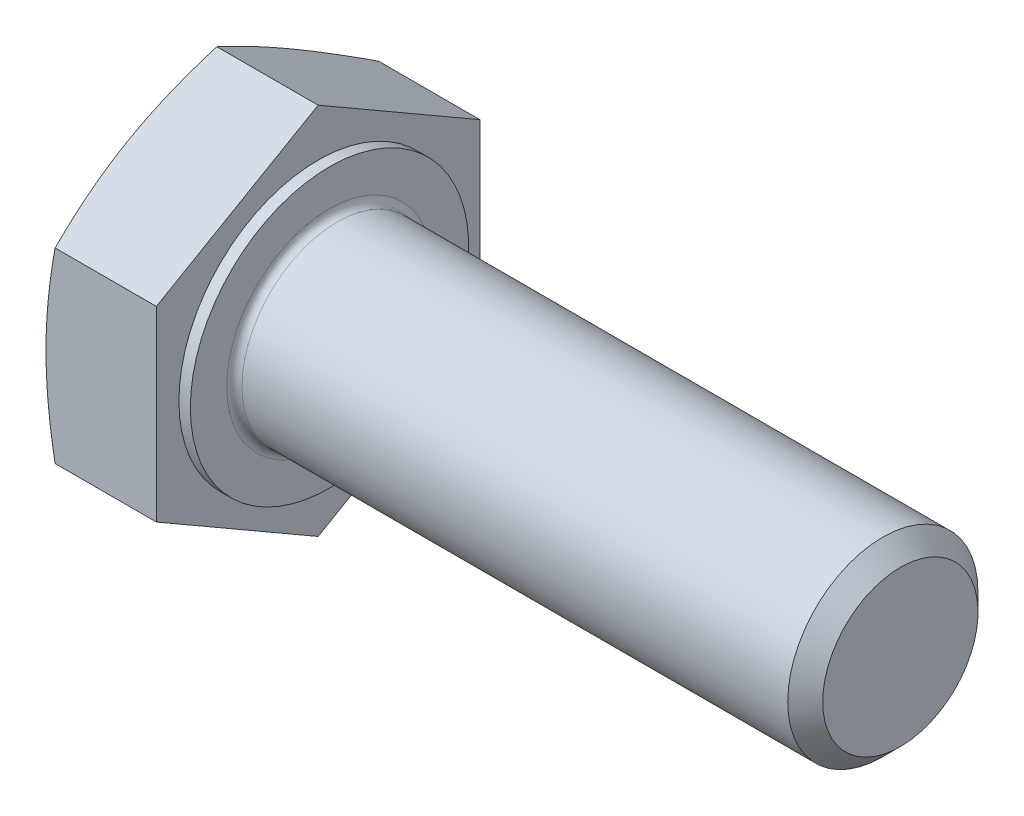
ISO-10303-21;
HEADER;
FILE_DESCRIPTION(('STEP AP214'),'2;1');
FILE_NAME('part.step','',(''),(''),'','','');
FILE_SCHEMA(('AUTOMOTIVE_DESIGN { 1 0 10303 214 1 1 1 1 }'));
ENDSEC;
DATA;
#1=APPLICATION_CONTEXT('core data for automotive mechanical design processes');
#2=APPLICATION_PROTOCOL_DEFINITION('international standard','automotive_design',2000,#1);
#3=PRODUCT_CONTEXT('',#1,'mechanical');
#4=PRODUCT('Part','Part','',(#3));
#5=PRODUCT_RELATED_PRODUCT_CATEGORY('part','',(#4));
#6=PRODUCT_DEFINITION_FORMATION('','',#4);
#7=PRODUCT_DEFINITION_CONTEXT('part definition',#1,'design');
#8=PRODUCT_DEFINITION('design','',#6,#7);
#9=PRODUCT_DEFINITION_SHAPE('','',#8);
#10=(LENGTH_UNIT() NAMED_UNIT(*) SI_UNIT(.MILLI.,.METRE.));
#11=(NAMED_UNIT(*) PLANE_ANGLE_UNIT() SI_UNIT($,.RADIAN.));
#12=(NAMED_UNIT(*) SI_UNIT($,.STERADIAN.) SOLID_ANGLE_UNIT());
#13=UNCERTAINTY_MEASURE_WITH_UNIT(LENGTH_MEASURE(1.E-05),#10,'distance_accuracy_value','');
#14=(GEOMETRIC_REPRESENTATION_CONTEXT(3) GLOBAL_UNCERTAINTY_ASSIGNED_CONTEXT((#13)) GLOBAL_UNIT_ASSIGNED_CONTEXT((#10,
#11,#12)) REPRESENTATION_CONTEXT('',''));
#15=CARTESIAN_POINT('',(0.,0.,0.));
#16=DIRECTION('',(0.,0.,1.));
#17=DIRECTION('',(1.,0.,0.));
#18=AXIS2_PLACEMENT_3D('',#15,#16,#17);
#19=CARTESIAN_POINT('',(-6.4,4.25,0.));
#20=DIRECTION('',(-1.,0.,0.));
#21=DIRECTION('',(0.,0.,1.));
#22=AXIS2_PLACEMENT_3D('',#19,#20,#21);
#23=PLANE('',#22);
#24=CARTESIAN_POINT('',(-6.40000000000127,0.,0.));
#25=DIRECTION('',(1.,0.,0.));
#26=DIRECTION('',(0.,0.,-1.));
#27=AXIS2_PLACEMENT_3D('',#24,#25,#26);
#28=CIRCLE('',#27,8.50000000000047);
#29=CARTESIAN_POINT('',(-6.40000000000136,0.,8.50000000000023));
#30=VERTEX_POINT('',#29);
#31=CARTESIAN_POINT('',(-6.40000000000136,-7.36121593216793,4.25000000000011));
#32=VERTEX_POINT('',#31);
#33=EDGE_CURVE('E90',#30,#32,#28,.T.);
#34=ORIENTED_EDGE('',*,*,#33,.F.);
#35=CARTESIAN_POINT('',(-6.40000000000128,0.,0.));
#36=DIRECTION('',(1.,0.,0.));
#37=DIRECTION('',(0.,0.,-1.));
#38=AXIS2_PLACEMENT_3D('',#35,#36,#37);
#39=CIRCLE('',#38,8.50000000000046);
#40=CARTESIAN_POINT('',(-6.40000000000136,7.36121593216793,4.25000000000012));
#41=VERTEX_POINT('',#40);
#42=EDGE_CURVE('E87',#41,#30,#39,.T.);
#43=ORIENTED_EDGE('',*,*,#42,.F.);
#44=CARTESIAN_POINT('',(-6.40000000000127,0.,0.));
#45=DIRECTION('',(1.,0.,0.));
#46=DIRECTION('',(0.,0.,-1.));
#47=AXIS2_PLACEMENT_3D('',#44,#45,#46);
#48=CIRCLE('',#47,8.50000000000047);
#49=CARTESIAN_POINT('',(-6.40000000000136,7.36121593216793,-4.25000000000012));
#50=VERTEX_POINT('',#49);
#51=EDGE_CURVE('E19',#50,#41,#48,.T.);
#52=ORIENTED_EDGE('',*,*,#51,.F.);
#53=CARTESIAN_POINT('',(-6.40000000000127,0.,0.));
#54=DIRECTION('',(1.,0.,0.));
#55=DIRECTION('',(0.,0.,-1.));
#56=AXIS2_PLACEMENT_3D('',#53,#54,#55);
#57=CIRCLE('',#56,8.50000000000047);
#58=CARTESIAN_POINT('',(-6.40000000000136,0.,-8.50000000000023));
#59=VERTEX_POINT('',#58);
#60=EDGE_CURVE('E506',#59,#50,#57,.T.);
#61=ORIENTED_EDGE('',*,*,#60,.F.);
#62=CARTESIAN_POINT('',(-6.40000000000128,0.,0.));
#63=DIRECTION('',(1.,0.,0.));
#64=DIRECTION('',(0.,0.,-1.));
#65=AXIS2_PLACEMENT_3D('',#62,#63,#64);
#66=CIRCLE('',#65,8.50000000000046);
#67=CARTESIAN_POINT('',(-6.40000000000136,-7.36121593216793,-4.25000000000011));
#68=VERTEX_POINT('',#67);
#69=EDGE_CURVE('E147',#68,#59,#66,.T.);
#70=ORIENTED_EDGE('',*,*,#69,.F.);
#71=CARTESIAN_POINT('',(-6.40000000000127,0.,0.));
#72=DIRECTION('',(1.,0.,0.));
#73=DIRECTION('',(0.,0.,-1.));
#74=AXIS2_PLACEMENT_3D('',#71,#72,#73);
#75=CIRCLE('',#74,8.50000000000047);
#76=EDGE_CURVE('E509',#32,#68,#75,.T.);
#77=ORIENTED_EDGE('',*,*,#76,.F.);
#78=EDGE_LOOP('',(#34,#43,#52,#61,#70,#77));
#79=FACE_BOUND('',#78,.T.);
#80=ADVANCED_FACE('F16',(#79),#23,.T.);
#81=CARTESIAN_POINT('',(-5.918524048893,0.,0.));
#82=DIRECTION('',(1.,0.,0.));
#83=DIRECTION('',(0.,0.,-1.));
#84=AXIS2_PLACEMENT_3D('',#81,#82,#83);
#85=CONICAL_SURFACE('',#84,9.82284430368152,1.22173047639618);
#86=CARTESIAN_POINT('',(-5.92139567484408,9.81495457622379,2.54587123403679E-13));
#87=CARTESIAN_POINT('',(-5.99514021020739,9.61243007709429,-0.350782722269461));
#88=CARTESIAN_POINT('',(-6.06224062107865,9.40922554203592,-0.702743301318972));
#89=CARTESIAN_POINT('',(-6.18019462424627,9.00208128296604,-1.407937844038));
#90=CARTESIAN_POINT('',(-6.23108168234717,8.79814396360323,-1.76116764273378));
#91=CARTESIAN_POINT('',(-6.29326632530469,8.49147018097733,-2.29234221559119));
#92=CARTESIAN_POINT('',(-6.31163978869926,8.38909117213201,-2.46966786053981));
#93=CARTESIAN_POINT('',(-6.34338074151676,8.18413855501416,-2.82465620653214));
#94=CARTESIAN_POINT('',(-6.35674826774736,8.08156494817804,-3.00231890508789));
#95=CARTESIAN_POINT('',(-6.37826159371544,7.87606803857807,-3.35824999331343));
#96=CARTESIAN_POINT('',(-6.38639656999418,7.77314445086015,-3.53651887653813));
#97=CARTESIAN_POINT('',(-6.39727456026643,7.56721976510595,-3.89319089479707));
#98=CARTESIAN_POINT('',(-6.40001723033578,7.46421866254483,-4.07159403766854));
#99=CARTESIAN_POINT('',(-6.40000000000144,7.36121593216773,-4.25));
#100=B_SPLINE_CURVE_WITH_KNOTS('',3,(#86,#87,#88,#89,#90,#91,#92,#93,#94,#95,#96,#97,#98,#99),
.UNSPECIFIED.,.F.,.F.,(4,2,2,2,2,2,4),(0.,1.23530443060448,2.46804231165356,3.08472875732633,
3.70141066853513,4.31936411030344,4.93735696419116),.UNSPECIFIED.);
#101=CARTESIAN_POINT('',(-5.92139567484408,9.81495457622379,0.));
#102=VERTEX_POINT('',#101);
#103=EDGE_CURVE('E107',#102,#50,#100,.T.);
#104=ORIENTED_EDGE('',*,*,#103,.T.);
#105=ORIENTED_EDGE('',*,*,#51,.T.);
#106=CARTESIAN_POINT('',(-6.40000000000144,7.36121593216773,4.25));
#107=CARTESIAN_POINT('',(-6.40001723033578,7.46421866254483,4.07159403766855));
#108=CARTESIAN_POINT('',(-6.39727456026643,7.56721976510595,3.89319089479708));
#109=CARTESIAN_POINT('',(-6.38639656999418,7.77314445086015,3.53651887653814));
#110=CARTESIAN_POINT('',(-6.37826159371544,7.87606803857807,3.35824999331343));
#111=CARTESIAN_POINT('',(-6.35674826774736,8.08156494817804,3.00231890508789));
#112=CARTESIAN_POINT('',(-6.34338074151676,8.18413855501416,2.82465620653214));
#113=CARTESIAN_POINT('',(-6.31163978869926,8.38909117213201,2.46966786053982));
#114=CARTESIAN_POINT('',(-6.29326632530469,8.49147018097733,2.29234221559119));
#115=CARTESIAN_POINT('',(-6.23108168234717,8.79814396360323,1.76116764273378));
#116=CARTESIAN_POINT('',(-6.18019462424627,9.00208128296604,1.407937844038));
#117=CARTESIAN_POINT('',(-6.06224062107865,9.40922554203592,0.702743301318973));
#118=CARTESIAN_POINT('',(-5.99514021020739,9.6124300770943,0.350782722269461));
#119=CARTESIAN_POINT('',(-5.92139567484408,9.81495457622379,-2.55438031837585E-13));
#120=B_SPLINE_CURVE_WITH_KNOTS('',3,(#106,#107,#108,#109,#110,#111,#112,#113,#114,#115,#116,
#117,#118,#119),.UNSPECIFIED.,.F.,.F.,(4,2,2,2,2,2,4),(0.,0.617992853887719,1.23594629565604,
1.85262820686484,2.46931465253761,3.70205253358668,4.93735696419117),.UNSPECIFIED.);
#121=EDGE_CURVE('E101',#41,#102,#120,.T.);
#122=ORIENTED_EDGE('',*,*,#121,.T.);
#123=EDGE_LOOP('',(#104,#105,#122));
#124=FACE_BOUND('',#123,.T.);
#125=ADVANCED_FACE('F105',(#124),#85,.T.);
#126=CARTESIAN_POINT('',(-5.918524048893,0.,0.));
#127=DIRECTION('',(1.,0.,0.));
#128=DIRECTION('',(0.,0.,-1.));
#129=AXIS2_PLACEMENT_3D('',#126,#127,#128);
#130=CONICAL_SURFACE('',#129,9.82284430368152,1.22173047639618);
#131=CARTESIAN_POINT('',(-5.92139567484408,4.90747728811167,8.50000000000026));
#132=CARTESIAN_POINT('',(-5.99514021020739,5.11000178724116,8.14921727773054));
#133=CARTESIAN_POINT('',(-6.06224062107865,5.31320632229953,7.79725669868103));
#134=CARTESIAN_POINT('',(-6.18019462424627,5.72035058136942,7.092062155962));
#135=CARTESIAN_POINT('',(-6.23108168234717,5.92428790073223,6.73883235726622));
#136=CARTESIAN_POINT('',(-6.29326632530469,6.23096168335813,6.20765778440881));
#137=CARTESIAN_POINT('',(-6.31163978869926,6.33334069220345,6.03033213946018));
#138=CARTESIAN_POINT('',(-6.34338074151676,6.5382933093213,5.67534379346786));
#139=CARTESIAN_POINT('',(-6.35674826774736,6.64086691615741,5.49768109491211));
#140=CARTESIAN_POINT('',(-6.37826159371544,6.84636382575739,5.14175000668657));
#141=CARTESIAN_POINT('',(-6.38639656999418,6.9492874134753,4.96348112346186));
#142=CARTESIAN_POINT('',(-6.39727456026643,7.15521209922951,4.60680910520292));
#143=CARTESIAN_POINT('',(-6.40001723033578,7.25821320179063,4.42840596233146));
#144=CARTESIAN_POINT('',(-6.40000000000144,7.36121593216773,4.25));
#145=B_SPLINE_CURVE_WITH_KNOTS('',3,(#131,#132,#133,#134,#135,#136,#137,#138,#139,#140,#141,
#142,#143,#144),.UNSPECIFIED.,.F.,.F.,(4,2,2,2,2,2,4),(0.,1.23530443060448,2.46804231165356,
3.08472875732633,3.70141066853513,4.31936411030345,4.93735696419117),.UNSPECIFIED.);
#146=CARTESIAN_POINT('',(-5.92139567484408,4.90747728811189,8.50000000000013));
#147=VERTEX_POINT('',#146);
#148=EDGE_CURVE('E95',#147,#41,#145,.T.);
#149=ORIENTED_EDGE('',*,*,#148,.T.);
#150=ORIENTED_EDGE('',*,*,#42,.T.);
#151=CARTESIAN_POINT('',(-6.40000000000144,0.,8.5));
#152=CARTESIAN_POINT('',(-6.40001723033578,0.2060054607542,8.5));
#153=CARTESIAN_POINT('',(-6.39727456026643,0.412007665876436,8.5));
#154=CARTESIAN_POINT('',(-6.38639656999418,0.823857037384849,8.5));
#155=CARTESIAN_POINT('',(-6.37826159371544,1.02970421282068,8.5));
#156=CARTESIAN_POINT('',(-6.35674826774736,1.44069803202063,8.5));
#157=CARTESIAN_POINT('',(-6.34338074151676,1.64584524569286,8.5));
#158=CARTESIAN_POINT('',(-6.31163978869926,2.05575047992856,8.5));
#159=CARTESIAN_POINT('',(-6.29326632530469,2.26050849761919,8.5));
#160=CARTESIAN_POINT('',(-6.23108168234717,2.873856062871,8.5));
#161=CARTESIAN_POINT('',(-6.18019462424627,3.28173070159661,8.5));
#162=CARTESIAN_POINT('',(-6.06224062107865,4.09601921973639,8.5));
#163=CARTESIAN_POINT('',(-5.99514021020739,4.50242828985313,8.5));
#164=CARTESIAN_POINT('',(-5.92139567484408,4.90747728811211,8.5));
#165=B_SPLINE_CURVE_WITH_KNOTS('',3,(#151,#152,#153,#154,#155,#156,#157,#158,#159,#160,#161,
#162,#163,#164),.UNSPECIFIED.,.F.,.F.,(4,2,2,2,2,2,4),(0.,0.617992853887719,1.23594629565604,
1.85262820686484,2.46931465253761,3.70205253358668,4.93735696419116),.UNSPECIFIED.);
#166=EDGE_CURVE('E97',#30,#147,#165,.T.);
#167=ORIENTED_EDGE('',*,*,#166,.T.);
#168=EDGE_LOOP('',(#149,#150,#167));
#169=FACE_BOUND('',#168,.T.);
#170=ADVANCED_FACE('F96',(#169),#130,.T.);
#171=CARTESIAN_POINT('',(-5.918524048893,0.,0.));
#172=DIRECTION('',(1.,0.,0.));
#173=DIRECTION('',(0.,0.,-1.));
#174=AXIS2_PLACEMENT_3D('',#171,#172,#173);
#175=CONICAL_SURFACE('',#174,9.82284430368152,1.22173047639618);
#176=CARTESIAN_POINT('',(-5.92139567484408,-4.90747728811211,8.5));
#177=CARTESIAN_POINT('',(-5.99514021020739,-4.50242828985313,8.5));
#178=CARTESIAN_POINT('',(-6.06224062107865,-4.09601921973639,8.5));
#179=CARTESIAN_POINT('',(-6.18019462424627,-3.28173070159661,8.5));
#180=CARTESIAN_POINT('',(-6.23108168234717,-2.873856062871,8.5));
#181=CARTESIAN_POINT('',(-6.29326632530469,-2.26050849761919,8.5));
#182=CARTESIAN_POINT('',(-6.31163978869926,-2.05575047992856,8.5));
#183=CARTESIAN_POINT('',(-6.34338074151676,-1.64584524569286,8.5));
#184=CARTESIAN_POINT('',(-6.35674826774736,-1.44069803202063,8.5));
#185=CARTESIAN_POINT('',(-6.37826159371544,-1.02970421282068,8.5));
#186=CARTESIAN_POINT('',(-6.38639656999418,-0.823857037384847,8.5));
#187=CARTESIAN_POINT('',(-6.39727456026643,-0.412007665876435,8.5));
#188=CARTESIAN_POINT('',(-6.40001723033578,-0.206005460754199,8.5));
#189=CARTESIAN_POINT('',(-6.40000000000144,0.,8.5));
#190=B_SPLINE_CURVE_WITH_KNOTS('',3,(#176,#177,#178,#179,#180,#181,#182,#183,#184,#185,#186,
#187,#188,#189),.UNSPECIFIED.,.F.,.F.,(4,2,2,2,2,2,4),(0.,1.23530443060449,2.46804231165356,
3.08472875732633,3.70141066853513,4.31936411030345,4.93735696419116),.UNSPECIFIED.);
#191=CARTESIAN_POINT('',(-5.92139567484408,-4.90747728811189,8.50000000000013));
#192=VERTEX_POINT('',#191);
#193=EDGE_CURVE('E114',#192,#30,#190,.T.);
#194=ORIENTED_EDGE('',*,*,#193,.T.);
#195=ORIENTED_EDGE('',*,*,#33,.T.);
#196=CARTESIAN_POINT('',(-6.40000000000144,-7.36121593216773,4.25));
#197=CARTESIAN_POINT('',(-6.40001723033578,-7.25821320179063,4.42840596233145));
#198=CARTESIAN_POINT('',(-6.39727456026643,-7.15521209922951,4.60680910520292));
#199=CARTESIAN_POINT('',(-6.38639656999418,-6.9492874134753,4.96348112346186));
#200=CARTESIAN_POINT('',(-6.37826159371544,-6.84636382575739,5.14175000668657));
#201=CARTESIAN_POINT('',(-6.35674826774736,-6.64086691615741,5.49768109491211));
#202=CARTESIAN_POINT('',(-6.34338074151676,-6.5382933093213,5.67534379346786));
#203=CARTESIAN_POINT('',(-6.31163978869926,-6.33334069220345,6.03033213946018));
#204=CARTESIAN_POINT('',(-6.29326632530469,-6.23096168335813,6.20765778440881));
#205=CARTESIAN_POINT('',(-6.23108168234717,-5.92428790073223,6.73883235726622));
#206=CARTESIAN_POINT('',(-6.18019462424627,-5.72035058136942,7.092062155962));
#207=CARTESIAN_POINT('',(-6.06224062107865,-5.31320632229953,7.79725669868103));
#208=CARTESIAN_POINT('',(-5.99514021020739,-5.11000178724116,8.14921727773054));
#209=CARTESIAN_POINT('',(-5.92139567484408,-4.90747728811167,8.50000000000026));
#210=B_SPLINE_CURVE_WITH_KNOTS('',3,(#196,#197,#198,#199,#200,#201,#202,#203,#204,#205,#206,
#207,#208,#209),.UNSPECIFIED.,.F.,.F.,(4,2,2,2,2,2,4),(0.,0.61799285388772,1.23594629565604,
1.85262820686484,2.46931465253761,3.70205253358668,4.93735696419117),.UNSPECIFIED.);
#211=EDGE_CURVE('E228',#32,#192,#210,.T.);
#212=ORIENTED_EDGE('',*,*,#211,.T.);
#213=EDGE_LOOP('',(#194,#195,#212));
#214=FACE_BOUND('',#213,.T.);
#215=ADVANCED_FACE('F217',(#214),#175,.T.);
#216=CARTESIAN_POINT('',(-5.918524048893,0.,0.));
#217=DIRECTION('',(1.,0.,0.));
#218=DIRECTION('',(0.,0.,-1.));
#219=AXIS2_PLACEMENT_3D('',#216,#217,#218);
#220=CONICAL_SURFACE('',#219,9.82284430368152,1.22173047639618);
#221=ORIENTED_EDGE('',*,*,#76,.T.);
#222=CARTESIAN_POINT('',(-6.40000000000144,-7.36121593216773,-4.25));
#223=CARTESIAN_POINT('',(-6.40001723033578,-7.46421866254483,-4.07159403766854));
#224=CARTESIAN_POINT('',(-6.39727456026643,-7.56721976510595,-3.89319089479707));
#225=CARTESIAN_POINT('',(-6.38639656999418,-7.77314445086015,-3.53651887653813));
#226=CARTESIAN_POINT('',(-6.37826159371544,-7.87606803857807,-3.35824999331343));
#227=CARTESIAN_POINT('',(-6.35674826774736,-8.08156494817804,-3.00231890508789));
#228=CARTESIAN_POINT('',(-6.34338074151676,-8.18413855501416,-2.82465620653214));
#229=CARTESIAN_POINT('',(-6.31163978869926,-8.38909117213201,-2.46966786053981));
#230=CARTESIAN_POINT('',(-6.29326632530469,-8.49147018097733,-2.29234221559119));
#231=CARTESIAN_POINT('',(-6.23108168234717,-8.79814396360323,-1.76116764273378));
#232=CARTESIAN_POINT('',(-6.18019462424627,-9.00208128296604,-1.407937844038));
#233=CARTESIAN_POINT('',(-6.06224062107865,-9.40922554203592,-0.702743301318973));
#234=CARTESIAN_POINT('',(-5.99514021020739,-9.6124300770943,-0.350782722269462));
#235=CARTESIAN_POINT('',(-5.92139567484408,-9.81495457622379,2.54979865880636E-13));
#236=B_SPLINE_CURVE_WITH_KNOTS('',3,(#222,#223,#224,#225,#226,#227,#228,#229,#230,#231,#232,
#233,#234,#235),.UNSPECIFIED.,.F.,.F.,(4,2,2,2,2,2,4),(0.,0.617992853887719,1.23594629565604,
1.85262820686484,2.46931465253761,3.70205253358668,4.93735696419116),.UNSPECIFIED.);
#237=CARTESIAN_POINT('',(-5.92139567484408,-9.81495457622379,0.));
#238=VERTEX_POINT('',#237);
#239=EDGE_CURVE('E208',#68,#238,#236,.T.);
#240=ORIENTED_EDGE('',*,*,#239,.T.);
#241=CARTESIAN_POINT('',(-5.92139567484408,-9.81495457622379,-2.5423808740031E-13));
#242=CARTESIAN_POINT('',(-5.99514021020739,-9.6124300770943,0.350782722269464));
#243=CARTESIAN_POINT('',(-6.06224062107865,-9.40922554203592,0.702743301318974));
#244=CARTESIAN_POINT('',(-6.18019462424627,-9.00208128296604,1.407937844038));
#245=CARTESIAN_POINT('',(-6.23108168234717,-8.79814396360323,1.76116764273378));
#246=CARTESIAN_POINT('',(-6.29326632530469,-8.49147018097732,2.29234221559119));
#247=CARTESIAN_POINT('',(-6.31163978869926,-8.38909117213201,2.46966786053982));
#248=CARTESIAN_POINT('',(-6.34338074151676,-8.18413855501416,2.82465620653214));
#249=CARTESIAN_POINT('',(-6.35674826774736,-8.08156494817804,3.00231890508789));
#250=CARTESIAN_POINT('',(-6.37826159371544,-7.87606803857807,3.35824999331343));
#251=CARTESIAN_POINT('',(-6.38639656999418,-7.77314445086015,3.53651887653813));
#252=CARTESIAN_POINT('',(-6.39727456026643,-7.56721976510595,3.89319089479707));
#253=CARTESIAN_POINT('',(-6.40001723033578,-7.46421866254483,4.07159403766854));
#254=CARTESIAN_POINT('',(-6.40000000000144,-7.36121593216773,4.25));
#255=B_SPLINE_CURVE_WITH_KNOTS('',3,(#241,#242,#243,#244,#245,#246,#247,#248,#249,#250,#251,
#252,#253,#254),.UNSPECIFIED.,.F.,.F.,(4,2,2,2,2,2,4),(0.,1.23530443060448,2.46804231165356,
3.08472875732633,3.70141066853513,4.31936411030344,4.93735696419116),.UNSPECIFIED.);
#256=EDGE_CURVE('E222',#238,#32,#255,.T.);
#257=ORIENTED_EDGE('',*,*,#256,.T.);
#258=EDGE_LOOP('',(#221,#240,#257));
#259=FACE_BOUND('',#258,.T.);
#260=ADVANCED_FACE('F214',(#259),#220,.T.);
#261=CARTESIAN_POINT('',(-5.918524048893,0.,0.));
#262=DIRECTION('',(1.,0.,0.));
#263=DIRECTION('',(0.,0.,-1.));
#264=AXIS2_PLACEMENT_3D('',#261,#262,#263);
#265=CONICAL_SURFACE('',#264,9.82284430368152,1.22173047639618);
#266=ORIENTED_EDGE('',*,*,#60,.T.);
#267=CARTESIAN_POINT('',(-6.40000000000145,7.36121593216773,-4.25));
#268=CARTESIAN_POINT('',(-6.40001723033579,7.25821320179063,-4.42840596233145));
#269=CARTESIAN_POINT('',(-6.39727456026643,7.15521209922951,-4.60680910520292));
#270=CARTESIAN_POINT('',(-6.38639656999418,6.9492874134753,-4.96348112346186));
#271=CARTESIAN_POINT('',(-6.37826159371544,6.84636382575739,-5.14175000668657));
#272=CARTESIAN_POINT('',(-6.35674826774736,6.64086691615741,-5.49768109491211));
#273=CARTESIAN_POINT('',(-6.34338074151676,6.5382933093213,-5.67534379346786));
#274=CARTESIAN_POINT('',(-6.31163978869926,6.33334069220345,-6.03033213946018));
#275=CARTESIAN_POINT('',(-6.29326632530469,6.23096168335813,-6.20765778440881));
#276=CARTESIAN_POINT('',(-6.23108168234717,5.92428790073223,-6.73883235726622));
#277=CARTESIAN_POINT('',(-6.18019462424627,5.72035058136942,-7.092062155962));
#278=CARTESIAN_POINT('',(-6.06224062107865,5.31320632229953,-7.79725669868103));
#279=CARTESIAN_POINT('',(-5.99514021020739,5.11000178724116,-8.14921727773054));
#280=CARTESIAN_POINT('',(-5.92139567484408,4.90747728811167,-8.50000000000026));
#281=B_SPLINE_CURVE_WITH_KNOTS('',3,(#267,#268,#269,#270,#271,#272,#273,#274,#275,#276,#277,
#278,#279,#280),.UNSPECIFIED.,.F.,.F.,(4,2,2,2,2,2,4),(0.,0.617992853887719,1.23594629565604,
1.85262820686484,2.46931465253761,3.70205253358668,4.93735696419117),.UNSPECIFIED.);
#282=CARTESIAN_POINT('',(-5.92139567484411,4.90747728811175,-8.50000000000013));
#283=VERTEX_POINT('',#282);
#284=EDGE_CURVE('E102',#50,#283,#281,.T.);
#285=ORIENTED_EDGE('',*,*,#284,.T.);
#286=CARTESIAN_POINT('',(-5.92139567484408,4.90747728811211,-8.5));
#287=CARTESIAN_POINT('',(-5.99514021020739,4.50242828985313,-8.5));
#288=CARTESIAN_POINT('',(-6.06224062107865,4.09601921973639,-8.5));
#289=CARTESIAN_POINT('',(-6.18019462424627,3.28173070159661,-8.5));
#290=CARTESIAN_POINT('',(-6.23108168234717,2.873856062871,-8.5));
#291=CARTESIAN_POINT('',(-6.29326632530469,2.26050849761919,-8.5));
#292=CARTESIAN_POINT('',(-6.31163978869926,2.05575047992856,-8.5));
#293=CARTESIAN_POINT('',(-6.34338074151676,1.64584524569286,-8.5));
#294=CARTESIAN_POINT('',(-6.35674826774736,1.44069803202063,-8.5));
#295=CARTESIAN_POINT('',(-6.37826159371544,1.02970421282068,-8.5));
#296=CARTESIAN_POINT('',(-6.38639656999418,0.823857037384847,-8.5));
#297=CARTESIAN_POINT('',(-6.39727456026643,0.412007665876434,-8.5));
#298=CARTESIAN_POINT('',(-6.40001723033579,0.206005460754197,-8.5));
#299=CARTESIAN_POINT('',(-6.40000000000144,0.,-8.5));
#300=B_SPLINE_CURVE_WITH_KNOTS('',3,(#286,#287,#288,#289,#290,#291,#292,#293,#294,#295,#296,
#297,#298,#299),.UNSPECIFIED.,.F.,.F.,(4,2,2,2,2,2,4),(0.,1.23530443060448,2.46804231165356,
3.08472875732633,3.70141066853513,4.31936411030345,4.93735696419117),.UNSPECIFIED.);
#301=EDGE_CURVE('E186',#283,#59,#300,.T.);
#302=ORIENTED_EDGE('',*,*,#301,.T.);
#303=EDGE_LOOP('',(#266,#285,#302));
#304=FACE_BOUND('',#303,.T.);
#305=ADVANCED_FACE('F163',(#304),#265,.T.);
#306=CARTESIAN_POINT('',(-5.918524048893,0.,0.));
#307=DIRECTION('',(1.,0.,0.));
#308=DIRECTION('',(0.,0.,-1.));
#309=AXIS2_PLACEMENT_3D('',#306,#307,#308);
#310=CONICAL_SURFACE('',#309,9.82284430368152,1.22173047639618);
#311=ORIENTED_EDGE('',*,*,#69,.T.);
#312=CARTESIAN_POINT('',(-6.40000000000144,0.,-8.5));
#313=CARTESIAN_POINT('',(-6.40001723033578,-0.2060054607542,-8.5));
#314=CARTESIAN_POINT('',(-6.39727456026643,-0.412007665876437,-8.5));
#315=CARTESIAN_POINT('',(-6.38639656999418,-0.823857037384849,-8.5));
#316=CARTESIAN_POINT('',(-6.37826159371544,-1.02970421282068,-8.5));
#317=CARTESIAN_POINT('',(-6.35674826774736,-1.44069803202063,-8.5));
#318=CARTESIAN_POINT('',(-6.34338074151676,-1.64584524569287,-8.5));
#319=CARTESIAN_POINT('',(-6.31163978869926,-2.05575047992856,-8.5));
#320=CARTESIAN_POINT('',(-6.29326632530469,-2.26050849761919,-8.5));
#321=CARTESIAN_POINT('',(-6.23108168234717,-2.873856062871,-8.5));
#322=CARTESIAN_POINT('',(-6.18019462424627,-3.28173070159662,-8.5));
#323=CARTESIAN_POINT('',(-6.06224062107865,-4.09601921973639,-8.5));
#324=CARTESIAN_POINT('',(-5.99514021020739,-4.50242828985313,-8.5));
#325=CARTESIAN_POINT('',(-5.92139567484408,-4.90747728811212,-8.5));
#326=B_SPLINE_CURVE_WITH_KNOTS('',3,(#312,#313,#314,#315,#316,#317,#318,#319,#320,#321,#322,
#323,#324,#325),.UNSPECIFIED.,.F.,.F.,(4,2,2,2,2,2,4),(0.,0.617992853887718,1.23594629565604,
1.85262820686484,2.46931465253761,3.70205253358668,4.93735696419117),.UNSPECIFIED.);
#327=CARTESIAN_POINT('',(-5.92139567484408,-4.90747728811189,-8.50000000000013));
#328=VERTEX_POINT('',#327);
#329=EDGE_CURVE('E178',#59,#328,#326,.T.);
#330=ORIENTED_EDGE('',*,*,#329,.T.);
#331=CARTESIAN_POINT('',(-5.92139567484408,-4.90747728811167,-8.50000000000025));
#332=CARTESIAN_POINT('',(-5.99514021020739,-5.11000178724116,-8.14921727773054));
#333=CARTESIAN_POINT('',(-6.06224062107865,-5.31320632229954,-7.79725669868102));
#334=CARTESIAN_POINT('',(-6.18019462424627,-5.72035058136942,-7.09206215596199));
#335=CARTESIAN_POINT('',(-6.23108168234717,-5.92428790073223,-6.73883235726622));
#336=CARTESIAN_POINT('',(-6.29326632530469,-6.23096168335814,-6.20765778440881));
#337=CARTESIAN_POINT('',(-6.31163978869926,-6.33334069220345,-6.03033213946018));
#338=CARTESIAN_POINT('',(-6.34338074151676,-6.5382933093213,-5.67534379346786));
#339=CARTESIAN_POINT('',(-6.35674826774736,-6.64086691615741,-5.49768109491211));
#340=CARTESIAN_POINT('',(-6.37826159371544,-6.84636382575739,-5.14175000668657));
#341=CARTESIAN_POINT('',(-6.38639656999418,-6.9492874134753,-4.96348112346186));
#342=CARTESIAN_POINT('',(-6.39727456026643,-7.15521209922951,-4.60680910520292));
#343=CARTESIAN_POINT('',(-6.40001723033579,-7.25821320179063,-4.42840596233145));
#344=CARTESIAN_POINT('',(-6.40000000000145,-7.36121593216773,-4.25));
#345=B_SPLINE_CURVE_WITH_KNOTS('',3,(#331,#332,#333,#334,#335,#336,#337,#338,#339,#340,#341,
#342,#343,#344),.UNSPECIFIED.,.F.,.F.,(4,2,2,2,2,2,4),(0.,1.23530443060448,2.46804231165356,
3.08472875732633,3.70141066853513,4.31936411030344,4.93735696419116),.UNSPECIFIED.);
#346=EDGE_CURVE('E169',#328,#68,#345,.T.);
#347=ORIENTED_EDGE('',*,*,#346,.T.);
#348=EDGE_LOOP('',(#311,#330,#347));
#349=FACE_BOUND('',#348,.T.);
#350=ADVANCED_FACE('F158',(#349),#310,.T.);
#351=CARTESIAN_POINT('',(0.,9.81495457622364,0.));
#352=DIRECTION('',(0.,-0.866025403784439,0.5));
#353=DIRECTION('',(0.,-0.5,-0.866025403784439));
#354=AXIS2_PLACEMENT_3D('',#351,#352,#353);
#355=PLANE('',#354);
#356=DIRECTION('',(1.,0.,0.));
#357=VECTOR('',#356,1.);
#358=CARTESIAN_POINT('',(0.,4.90747728811182,-8.5));
#359=LINE('',#358,#357);
#360=CARTESIAN_POINT('',(-0.6,4.90747728811182,-8.5));
#361=VERTEX_POINT('',#360);
#362=EDGE_CURVE('E349',#361,#283,#359,.F.);
#363=ORIENTED_EDGE('',*,*,#362,.T.);
#364=ORIENTED_EDGE('',*,*,#284,.F.);
#365=ORIENTED_EDGE('',*,*,#103,.F.);
#366=DIRECTION('',(1.,0.,0.));
#367=VECTOR('',#366,1.);
#368=CARTESIAN_POINT('',(0.,9.81495457622364,0.));
#369=LINE('',#368,#367);
#370=CARTESIAN_POINT('',(-0.6,9.81495457622364,0.));
#371=VERTEX_POINT('',#370);
#372=EDGE_CURVE('E112',#102,#371,#369,.T.);
#373=ORIENTED_EDGE('',*,*,#372,.T.);
#374=DIRECTION('',(0.,0.5,0.866025403784439));
#375=VECTOR('',#374,1.);
#376=CARTESIAN_POINT('',(-0.6,4.90747728811182,-8.5));
#377=LINE('',#376,#375);
#378=EDGE_CURVE('E314',#361,#371,#377,.T.);
#379=ORIENTED_EDGE('',*,*,#378,.F.);
#380=EDGE_LOOP('',(#363,#364,#365,#373,#379));
#381=FACE_BOUND('',#380,.T.);
#382=ADVANCED_FACE('F154',(#381),#355,.F.);
#383=CARTESIAN_POINT('',(0.,4.90747728811182,8.5));
#384=DIRECTION('',(0.,-0.866025403784439,-0.5));
#385=DIRECTION('',(0.,0.5,-0.866025403784439));
#386=AXIS2_PLACEMENT_3D('',#383,#384,#385);
#387=PLANE('',#386);
#388=ORIENTED_EDGE('',*,*,#372,.F.);
#389=ORIENTED_EDGE('',*,*,#121,.F.);
#390=ORIENTED_EDGE('',*,*,#148,.F.);
#391=DIRECTION('',(-1.,0.,0.));
#392=VECTOR('',#391,1.);
#393=CARTESIAN_POINT('',(0.,4.90747728811182,8.5));
#394=LINE('',#393,#392);
#395=CARTESIAN_POINT('',(-0.6,4.90747728811182,8.5));
#396=VERTEX_POINT('',#395);
#397=EDGE_CURVE('E229',#147,#396,#394,.F.);
#398=ORIENTED_EDGE('',*,*,#397,.T.);
#399=DIRECTION('',(0.,-0.5,0.866025403784439));
#400=VECTOR('',#399,1.);
#401=CARTESIAN_POINT('',(-0.6,9.81495457622364,0.));
#402=LINE('',#401,#400);
#403=EDGE_CURVE('E310',#371,#396,#402,.T.);
#404=ORIENTED_EDGE('',*,*,#403,.F.);
#405=EDGE_LOOP('',(#388,#389,#390,#398,#404));
#406=FACE_BOUND('',#405,.T.);
#407=ADVANCED_FACE('F110',(#406),#387,.F.);
#408=CARTESIAN_POINT('',(0.,-4.90747728811182,8.5));
#409=DIRECTION('',(0.,0.,-1.));
#410=DIRECTION('',(-1.,0.,0.));
#411=AXIS2_PLACEMENT_3D('',#408,#409,#410);
#412=PLANE('',#411);
#413=ORIENTED_EDGE('',*,*,#397,.F.);
#414=ORIENTED_EDGE('',*,*,#166,.F.);
#415=ORIENTED_EDGE('',*,*,#193,.F.);
#416=DIRECTION('',(1.,0.,0.));
#417=VECTOR('',#416,1.);
#418=CARTESIAN_POINT('',(0.,-4.90747728811182,8.5));
#419=LINE('',#418,#417);
#420=CARTESIAN_POINT('',(-0.6,-4.90747728811182,8.5));
#421=VERTEX_POINT('',#420);
#422=EDGE_CURVE('E344',#192,#421,#419,.T.);
#423=ORIENTED_EDGE('',*,*,#422,.T.);
#424=DIRECTION('',(0.,1.,0.));
#425=VECTOR('',#424,1.);
#426=CARTESIAN_POINT('',(-0.6,10.4575,8.5));
#427=LINE('',#426,#425);
#428=EDGE_CURVE('E313',#396,#421,#427,.F.);
#429=ORIENTED_EDGE('',*,*,#428,.F.);
#430=EDGE_LOOP('',(#413,#414,#415,#423,#429));
#431=FACE_BOUND('',#430,.T.);
#432=ADVANCED_FACE('F238',(#431),#412,.F.);
#433=CARTESIAN_POINT('',(0.,-9.81495457622364,0.));
#434=DIRECTION('',(0.,0.866025403784439,-0.5));
#435=DIRECTION('',(0.,0.5,0.866025403784439));
#436=AXIS2_PLACEMENT_3D('',#433,#434,#435);
#437=PLANE('',#436);
#438=ORIENTED_EDGE('',*,*,#422,.F.);
#439=ORIENTED_EDGE('',*,*,#211,.F.);
#440=ORIENTED_EDGE('',*,*,#256,.F.);
#441=DIRECTION('',(1.,0.,0.));
#442=VECTOR('',#441,1.);
#443=CARTESIAN_POINT('',(0.,-9.81495457622364,0.));
#444=LINE('',#443,#442);
#445=CARTESIAN_POINT('',(-0.6,-9.81495457622364,0.));
#446=VERTEX_POINT('',#445);
#447=EDGE_CURVE('E213',#238,#446,#444,.T.);
#448=ORIENTED_EDGE('',*,*,#447,.T.);
#449=DIRECTION('',(0.,-0.5,-0.866025403784439));
#450=VECTOR('',#449,1.);
#451=CARTESIAN_POINT('',(-0.6,-4.90747728811182,8.5));
#452=LINE('',#451,#450);
#453=EDGE_CURVE('E319',#421,#446,#452,.T.);
#454=ORIENTED_EDGE('',*,*,#453,.F.);
#455=EDGE_LOOP('',(#438,#439,#440,#448,#454));
#456=FACE_BOUND('',#455,.T.);
#457=ADVANCED_FACE('F205',(#456),#437,.F.);
#458=CARTESIAN_POINT('',(0.,-4.90747728811182,-8.5));
#459=DIRECTION('',(0.,0.866025403784439,0.5));
#460=DIRECTION('',(0.,-0.5,0.866025403784439));
#461=AXIS2_PLACEMENT_3D('',#458,#459,#460);
#462=PLANE('',#461);
#463=ORIENTED_EDGE('',*,*,#447,.F.);
#464=ORIENTED_EDGE('',*,*,#239,.F.);
#465=ORIENTED_EDGE('',*,*,#346,.F.);
#466=DIRECTION('',(1.,0.,0.));
#467=VECTOR('',#466,1.);
#468=CARTESIAN_POINT('',(0.,-4.90747728811182,-8.5));
#469=LINE('',#468,#467);
#470=CARTESIAN_POINT('',(-0.6,-4.90747728811182,-8.5));
#471=VERTEX_POINT('',#470);
#472=EDGE_CURVE('E34',#328,#471,#469,.T.);
#473=ORIENTED_EDGE('',*,*,#472,.T.);
#474=DIRECTION('',(0.,0.5,-0.866025403784439));
#475=VECTOR('',#474,1.);
#476=CARTESIAN_POINT('',(-0.6,-9.81495457622364,0.));
#477=LINE('',#476,#475);
#478=EDGE_CURVE('E324',#446,#471,#477,.T.);
#479=ORIENTED_EDGE('',*,*,#478,.F.);
#480=EDGE_LOOP('',(#463,#464,#465,#473,#479));
#481=FACE_BOUND('',#480,.T.);
#482=ADVANCED_FACE('F198',(#481),#462,.F.);
#483=CARTESIAN_POINT('',(0.,4.90747728811182,-8.5));
#484=DIRECTION('',(0.,0.,1.));
#485=DIRECTION('',(1.,0.,0.));
#486=AXIS2_PLACEMENT_3D('',#483,#484,#485);
#487=PLANE('',#486);
#488=ORIENTED_EDGE('',*,*,#472,.F.);
#489=ORIENTED_EDGE('',*,*,#329,.F.);
#490=ORIENTED_EDGE('',*,*,#301,.F.);
#491=ORIENTED_EDGE('',*,*,#362,.F.);
#492=DIRECTION('',(0.,1.,0.));
#493=VECTOR('',#492,1.);
#494=CARTESIAN_POINT('',(-0.6,10.4575,-8.5));
#495=LINE('',#494,#493);
#496=EDGE_CURVE('E306',#471,#361,#495,.T.);
#497=ORIENTED_EDGE('',*,*,#496,.F.);
#498=EDGE_LOOP('',(#488,#489,#490,#491,#497));
#499=FACE_BOUND('',#498,.T.);
#500=ADVANCED_FACE('F193',(#499),#487,.F.);
#501=CARTESIAN_POINT('',(-0.6,10.4575,0.));
#502=DIRECTION('',(1.,0.,0.));
#503=DIRECTION('',(0.,0.,-1.));
#504=AXIS2_PLACEMENT_3D('',#501,#502,#503);
#505=PLANE('',#504);
#506=CARTESIAN_POINT('',(-0.6,0.,0.));
#507=DIRECTION('',(-1.,0.,0.));
#508=DIRECTION('',(0.,0.,1.));
#509=AXIS2_PLACEMENT_3D('',#506,#507,#508);
#510=CIRCLE('',#509,7.315);
#511=CARTESIAN_POINT('',(-0.6,0.,7.315));
#512=VERTEX_POINT('',#511);
#513=EDGE_CURVE('E187',#512,#512,#510,.F.);
#514=ORIENTED_EDGE('',*,*,#513,.F.);
#515=EDGE_LOOP('',(#514));
#516=FACE_BOUND('',#515,.T.);
#517=ORIENTED_EDGE('',*,*,#478,.T.);
#518=ORIENTED_EDGE('',*,*,#496,.T.);
#519=ORIENTED_EDGE('',*,*,#378,.T.);
#520=ORIENTED_EDGE('',*,*,#403,.T.);
#521=ORIENTED_EDGE('',*,*,#428,.T.);
#522=ORIENTED_EDGE('',*,*,#453,.T.);
#523=EDGE_LOOP('',(#517,#518,#519,#520,#521,#522));
#524=FACE_BOUND('',#523,.T.);
#525=ADVANCED_FACE('F197',(#516,#524),#505,.T.);
#526=CARTESIAN_POINT('',(-0.3,0.,0.));
#527=DIRECTION('',(-1.,0.,0.));
#528=DIRECTION('',(0.,0.,1.));
#529=AXIS2_PLACEMENT_3D('',#526,#527,#528);
#530=CYLINDRICAL_SURFACE('',#529,7.315);
#531=ORIENTED_EDGE('',*,*,#513,.T.);
#532=EDGE_LOOP('',(#531));
#533=FACE_BOUND('',#532,.T.);
#534=CARTESIAN_POINT('',(0.,0.,0.));
#535=DIRECTION('',(-1.,0.,0.));
#536=DIRECTION('',(0.,0.,1.));
#537=AXIS2_PLACEMENT_3D('',#534,#535,#536);
#538=CIRCLE('',#537,7.315);
#539=CARTESIAN_POINT('',(0.,0.,7.315));
#540=VERTEX_POINT('',#539);
#541=EDGE_CURVE('E301',#540,#540,#538,.F.);
#542=ORIENTED_EDGE('',*,*,#541,.F.);
#543=EDGE_LOOP('',(#542));
#544=FACE_BOUND('',#543,.T.);
#545=ADVANCED_FACE('F288',(#533,#544),#530,.T.);
#546=CARTESIAN_POINT('',(30.,2.04,0.));
#547=DIRECTION('',(1.,0.,0.));
#548=DIRECTION('',(0.,0.,-1.));
#549=AXIS2_PLACEMENT_3D('',#546,#547,#548);
#550=PLANE('',#549);
#551=CARTESIAN_POINT('',(29.9999999999727,0.,0.));
#552=DIRECTION('',(-1.,0.,0.));
#553=DIRECTION('',(0.,0.,1.));
#554=AXIS2_PLACEMENT_3D('',#551,#552,#553);
#555=CIRCLE('',#554,4.08000000004449);
#556=CARTESIAN_POINT('',(29.9999999999727,0.,4.08000000004449));
#557=VERTEX_POINT('',#556);
#558=EDGE_CURVE('E303',#557,#557,#555,.T.);
#559=ORIENTED_EDGE('',*,*,#558,.F.);
#560=EDGE_LOOP('',(#559));
#561=FACE_BOUND('',#560,.T.);
#562=ADVANCED_FACE('F286',(#561),#550,.T.);
#563=CARTESIAN_POINT('',(0.,6.3575,0.));
#564=DIRECTION('',(1.,0.,0.));
#565=DIRECTION('',(0.,0.,-1.));
#566=AXIS2_PLACEMENT_3D('',#563,#564,#565);
#567=PLANE('',#566);
#568=CARTESIAN_POINT('',(0.,0.,0.));
#569=DIRECTION('',(1.,0.,0.));
#570=DIRECTION('',(0.,1.,0.));
#571=AXIS2_PLACEMENT_3D('',#568,#569,#570);
#572=CIRCLE('',#571,5.4);
#573=CARTESIAN_POINT('',(0.,5.4,0.));
#574=VERTEX_POINT('',#573);
#575=EDGE_CURVE('E273',#574,#574,#572,.T.);
#576=ORIENTED_EDGE('',*,*,#575,.F.);
#577=EDGE_LOOP('',(#576));
#578=FACE_BOUND('',#577,.T.);
#579=ORIENTED_EDGE('',*,*,#541,.T.);
#580=EDGE_LOOP('',(#579));
#581=FACE_BOUND('',#580,.T.);
#582=ADVANCED_FACE('F277',(#578,#581),#567,.T.);
#583=CARTESIAN_POINT('',(29.0800000000218,0.,0.));
#584=DIRECTION('',(-1.,0.,0.));
#585=DIRECTION('',(0.,0.,1.));
#586=AXIS2_PLACEMENT_3D('',#583,#584,#585);
#587=CONICAL_SURFACE('',#586,4.99999999993861,0.785398163366555);
#588=ORIENTED_EDGE('',*,*,#558,.T.);
#589=EDGE_LOOP('',(#588));
#590=FACE_BOUND('',#589,.T.);
#591=CARTESIAN_POINT('',(29.08,0.,0.));
#592=DIRECTION('',(-1.,0.,0.));
#593=DIRECTION('',(0.,0.,1.));
#594=AXIS2_PLACEMENT_3D('',#591,#592,#593);
#595=CIRCLE('',#594,5.);
#596=CARTESIAN_POINT('',(29.08,0.,5.));
#597=VERTEX_POINT('',#596);
#598=EDGE_CURVE('E25',#597,#597,#595,.T.);
#599=ORIENTED_EDGE('',*,*,#598,.F.);
#600=EDGE_LOOP('',(#599));
#601=FACE_BOUND('',#600,.T.);
#602=ADVANCED_FACE('F257',(#590,#601),#587,.T.);
#603=CARTESIAN_POINT('',(0.399999999999998,0.,0.));
#604=DIRECTION('',(-1.,0.,0.));
#605=DIRECTION('',(0.,0.,1.));
#606=AXIS2_PLACEMENT_3D('',#603,#604,#605);
#607=TOROIDAL_SURFACE('',#606,5.4,0.399999999999998);
#608=CARTESIAN_POINT('',(0.400000000000001,0.,0.));
#609=DIRECTION('',(-1.,0.,0.));
#610=DIRECTION('',(0.,0.,1.));
#611=AXIS2_PLACEMENT_3D('',#608,#609,#610);
#612=CIRCLE('',#611,5.);
#613=CARTESIAN_POINT('',(0.400000000000001,0.,5.));
#614=VERTEX_POINT('',#613);
#615=EDGE_CURVE('E11',#614,#614,#612,.F.);
#616=ORIENTED_EDGE('',*,*,#615,.F.);
#617=EDGE_LOOP('',(#616));
#618=FACE_BOUND('',#617,.T.);
#619=ORIENTED_EDGE('',*,*,#575,.T.);
#620=EDGE_LOOP('',(#619));
#621=FACE_BOUND('',#620,.T.);
#622=ADVANCED_FACE('F251',(#618,#621),#607,.F.);
#623=CARTESIAN_POINT('',(14.74,0.,0.));
#624=DIRECTION('',(-1.,0.,0.));
#625=DIRECTION('',(0.,0.,1.));
#626=AXIS2_PLACEMENT_3D('',#623,#624,#625);
#627=CYLINDRICAL_SURFACE('',#626,5.);
#628=ORIENTED_EDGE('',*,*,#598,.T.);
#629=EDGE_LOOP('',(#628));
#630=FACE_BOUND('',#629,.T.);
#631=ORIENTED_EDGE('',*,*,#615,.T.);
#632=EDGE_LOOP('',(#631));
#633=FACE_BOUND('',#632,.T.);
#634=ADVANCED_FACE('F249',(#630,#633),#627,.T.);
#635=CLOSED_SHELL('',(#80,#125,#170,#215,#260,#305,#350,#382,#407,#432,#457,#482,#500,#525,#545,
#562,#582,#602,#622,#634));
#636=MANIFOLD_SOLID_BREP('B1',#635);
#637=ADVANCED_BREP_SHAPE_REPRESENTATION('',(#18,#636),#14);
#638=SHAPE_DEFINITION_REPRESENTATION(#9,#637);
ENDSEC;
END-ISO-10303-21;
